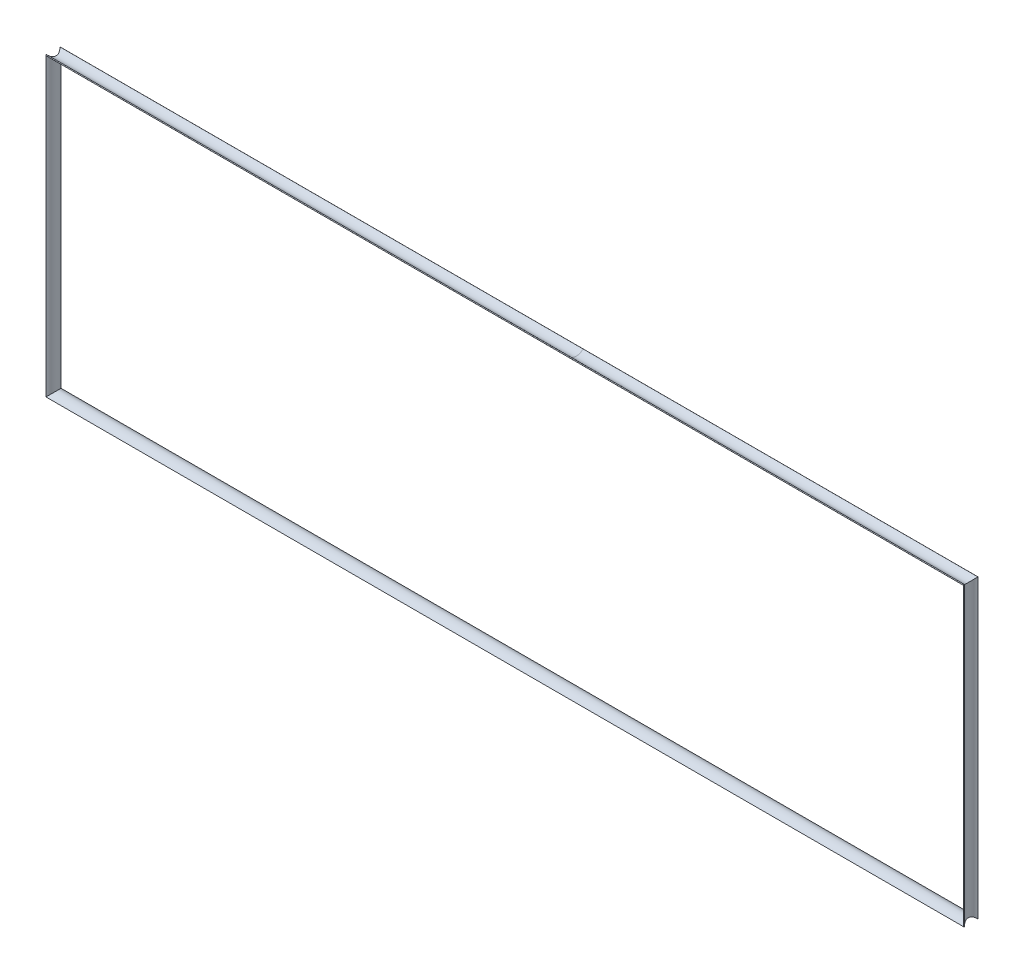
ISO-10303-21;
HEADER;
FILE_DESCRIPTION(('STEP AP214'),'2;1');
FILE_NAME('part.step','',(''),(''),'','','');
FILE_SCHEMA(('AUTOMOTIVE_DESIGN { 1 0 10303 214 1 1 1 1 }'));
ENDSEC;
DATA;
#1=APPLICATION_CONTEXT('core data for automotive mechanical design processes');
#2=APPLICATION_PROTOCOL_DEFINITION('international standard','automotive_design',2000,#1);
#3=PRODUCT_CONTEXT('',#1,'mechanical');
#4=PRODUCT('Part','Part','',(#3));
#5=PRODUCT_RELATED_PRODUCT_CATEGORY('part','',(#4));
#6=PRODUCT_DEFINITION_FORMATION('','',#4);
#7=PRODUCT_DEFINITION_CONTEXT('part definition',#1,'design');
#8=PRODUCT_DEFINITION('design','',#6,#7);
#9=PRODUCT_DEFINITION_SHAPE('','',#8);
#10=(LENGTH_UNIT() NAMED_UNIT(*) SI_UNIT(.MILLI.,.METRE.));
#11=(NAMED_UNIT(*) PLANE_ANGLE_UNIT() SI_UNIT($,.RADIAN.));
#12=(NAMED_UNIT(*) SI_UNIT($,.STERADIAN.) SOLID_ANGLE_UNIT());
#13=UNCERTAINTY_MEASURE_WITH_UNIT(LENGTH_MEASURE(1.E-05),#10,'distance_accuracy_value','');
#14=(GEOMETRIC_REPRESENTATION_CONTEXT(3) GLOBAL_UNCERTAINTY_ASSIGNED_CONTEXT((#13)) GLOBAL_UNIT_ASSIGNED_CONTEXT((#10,
#11,#12)) REPRESENTATION_CONTEXT('',''));
#15=CARTESIAN_POINT('',(0.,0.,0.));
#16=DIRECTION('',(0.,0.,1.));
#17=DIRECTION('',(1.,0.,0.));
#18=AXIS2_PLACEMENT_3D('',#15,#16,#17);
#19=CARTESIAN_POINT('',(-195.280679939792,-83.605890790914,2.55783681765596));
#20=DIRECTION('',(-0.772949387283598,0.,0.634467686094343));
#21=DIRECTION('',(0.634467686094343,0.,0.772949387283598));
#22=AXIS2_PLACEMENT_3D('',#19,#20,#21);
#23=PLANE('',#22);
#24=DIRECTION('',(0.,1.,0.));
#25=VECTOR('',#24,1.);
#26=CARTESIAN_POINT('',(-195.082811631117,-83.605890790914,2.79889273162191));
#27=LINE('',#26,#25);
#28=CARTESIAN_POINT('',(-195.082811631117,-83.273287821593,2.79889273162191));
#29=VERTEX_POINT('',#28);
#30=CARTESIAN_POINT('',(-195.082811631117,27.0256687739739,2.79889273162191));
#31=VERTEX_POINT('',#30);
#32=EDGE_CURVE('E38',#29,#31,#27,.T.);
#33=ORIENTED_EDGE('',*,*,#32,.T.);
#34=DIRECTION('',(-0.535735528742204,0.535735528742204,-0.652667516034483));
#35=VECTOR('',#34,1.);
#36=CARTESIAN_POINT('',(-195.319350479228,27.2622076220848,2.51072587659801));
#37=LINE('',#36,#35);
#38=CARTESIAN_POINT('',(-195.280679939792,27.2235370826491,2.55783681765596));
#39=VERTEX_POINT('',#38);
#40=EDGE_CURVE('E96',#31,#39,#37,.T.);
#41=ORIENTED_EDGE('',*,*,#40,.T.);
#42=DIRECTION('',(0.,1.,0.));
#43=VECTOR('',#42,1.);
#44=CARTESIAN_POINT('',(-195.280679939792,-83.605890790914,2.55783681765596));
#45=LINE('',#44,#43);
#46=CARTESIAN_POINT('',(-195.280679939792,-83.4711561302682,2.55783681765596));
#47=VERTEX_POINT('',#46);
#48=EDGE_CURVE('E167',#47,#39,#45,.T.);
#49=ORIENTED_EDGE('',*,*,#48,.F.);
#50=DIRECTION('',(-0.535735528742204,-0.535735528742204,-0.652667516034483));
#51=VECTOR('',#50,1.);
#52=CARTESIAN_POINT('',(-96.8843293143677,14.9251944951561,122.430606690375));
#53=LINE('',#52,#51);
#54=EDGE_CURVE('E227',#29,#47,#53,.T.);
#55=ORIENTED_EDGE('',*,*,#54,.F.);
#56=EDGE_LOOP('',(#33,#41,#49,#55));
#57=FACE_BOUND('',#56,.T.);
#58=ADVANCED_FACE('F35',(#57),#23,.T.);
#59=CARTESIAN_POINT('',(-197.480263626746,-83.605890790914,0.));
#60=DIRECTION('',(0.,1.,0.));
#61=DIRECTION('',(-1.,0.,0.));
#62=AXIS2_PLACEMENT_3D('',#59,#60,#61);
#63=CYLINDRICAL_SURFACE('',#62,3.37352895076791);
#64=ORIENTED_EDGE('',*,*,#48,.T.);
#65=CARTESIAN_POINT('',(-197.480263626746,29.4231207696028,0.));
#66=DIRECTION('',(0.707106781186547,0.707106781186547,0.));
#67=DIRECTION('',(0.707106781186548,-0.707106781186548,0.));
#68=AXIS2_PLACEMENT_3D('',#65,#66,#67);
#69=ELLIPSE('',#68,4.77089039523426,3.37352895076791);
#70=CARTESIAN_POINT('',(-195.21206854016,27.1549256830174,-2.49719615386114));
#71=VERTEX_POINT('',#70);
#72=EDGE_CURVE('E113',#39,#71,#69,.T.);
#73=ORIENTED_EDGE('',*,*,#72,.T.);
#74=DIRECTION('',(0.,1.,0.));
#75=VECTOR('',#74,1.);
#76=CARTESIAN_POINT('',(-195.21206854016,-83.605890790914,-2.49719615386114));
#77=LINE('',#76,#75);
#78=CARTESIAN_POINT('',(-195.21206854016,-83.4025447306364,-2.49719615386113));
#79=VERTEX_POINT('',#78);
#80=EDGE_CURVE('E109',#79,#71,#77,.T.);
#81=ORIENTED_EDGE('',*,*,#80,.F.);
#82=CARTESIAN_POINT('',(-197.480263626746,-85.6707398172219,0.));
#83=DIRECTION('',(-0.707106781186547,0.707106781186548,0.));
#84=DIRECTION('',(-0.707106781186548,-0.707106781186547,0.));
#85=AXIS2_PLACEMENT_3D('',#82,#83,#84);
#86=ELLIPSE('',#85,4.77089039523426,3.37352895076791);
#87=EDGE_CURVE('E173',#47,#79,#86,.T.);
#88=ORIENTED_EDGE('',*,*,#87,.F.);
#89=EDGE_LOOP('',(#64,#73,#81,#88));
#90=FACE_BOUND('',#89,.T.);
#91=ADVANCED_FACE('F171',(#90),#63,.F.);
#92=CARTESIAN_POINT('',(-195.002436190645,-83.605890790914,-2.72799336351454));
#93=DIRECTION('',(-0.74023261406804,0.,-0.672350858607316));
#94=DIRECTION('',(-0.672350858607316,0.,0.74023261406804));
#95=AXIS2_PLACEMENT_3D('',#92,#93,#94);
#96=PLANE('',#95);
#97=ORIENTED_EDGE('',*,*,#80,.T.);
#98=DIRECTION('',(0.557961623493486,-0.557961623493486,-0.614294435443644));
#99=VECTOR('',#98,1.);
#100=CARTESIAN_POINT('',(-195.131005113726,27.0738622565831,-2.5864438900491));
#101=LINE('',#100,#99);
#102=CARTESIAN_POINT('',(-195.002436190645,26.9452933335024,-2.72799336351454));
#103=VERTEX_POINT('',#102);
#104=EDGE_CURVE('E103',#71,#103,#101,.T.);
#105=ORIENTED_EDGE('',*,*,#104,.T.);
#106=DIRECTION('',(0.,1.,0.));
#107=VECTOR('',#106,1.);
#108=CARTESIAN_POINT('',(-195.002436190645,-83.605890790914,-2.72799336351454));
#109=LINE('',#108,#107);
#110=CARTESIAN_POINT('',(-195.002436190645,-83.1929123811215,-2.72799336351454));
#111=VERTEX_POINT('',#110);
#112=EDGE_CURVE('E106',#111,#103,#109,.T.);
#113=ORIENTED_EDGE('',*,*,#112,.F.);
#114=DIRECTION('',(0.557961623493486,0.557961623493486,-0.614294435443644));
#115=VECTOR('',#114,1.);
#116=CARTESIAN_POINT('',(-88.3589996366438,23.4505241728801,-120.138343633734));
#117=LINE('',#116,#115);
#118=EDGE_CURVE('E224',#79,#111,#117,.T.);
#119=ORIENTED_EDGE('',*,*,#118,.F.);
#120=EDGE_LOOP('',(#97,#105,#113,#119));
#121=FACE_BOUND('',#120,.T.);
#122=ADVANCED_FACE('F105',(#121),#96,.T.);
#123=CARTESIAN_POINT('',(-197.480263626746,-83.605890790914,0.));
#124=DIRECTION('',(0.,1.,0.));
#125=DIRECTION('',(-1.,0.,0.));
#126=AXIS2_PLACEMENT_3D('',#123,#124,#125);
#127=CYLINDRICAL_SURFACE('',#126,3.68531906277748);
#128=ORIENTED_EDGE('',*,*,#112,.T.);
#129=CARTESIAN_POINT('',(-197.480263626746,29.4231207696028,0.));
#130=DIRECTION('',(0.707106781186547,0.707106781186547,0.));
#131=DIRECTION('',(0.707106781186548,-0.707106781186548,0.));
#132=AXIS2_PLACEMENT_3D('',#129,#130,#131);
#133=ELLIPSE('',#132,5.21182820025201,3.68531906277748);
#134=EDGE_CURVE('E120',#103,#31,#133,.F.);
#135=ORIENTED_EDGE('',*,*,#134,.T.);
#136=ORIENTED_EDGE('',*,*,#32,.F.);
#137=CARTESIAN_POINT('',(-197.480263626746,-85.6707398172219,0.));
#138=DIRECTION('',(-0.707106781186547,0.707106781186548,0.));
#139=DIRECTION('',(-0.707106781186548,-0.707106781186547,0.));
#140=AXIS2_PLACEMENT_3D('',#137,#138,#139);
#141=ELLIPSE('',#140,5.21182820025201,3.68531906277748);
#142=EDGE_CURVE('E122',#111,#29,#141,.F.);
#143=ORIENTED_EDGE('',*,*,#142,.F.);
#144=EDGE_LOOP('',(#128,#135,#136,#143));
#145=FACE_BOUND('',#144,.T.);
#146=ADVANCED_FACE('F118',(#145),#127,.T.);
#147=CARTESIAN_POINT('',(-195.415414600438,29.4231207696028,0.));
#148=DIRECTION('',(1.,0.,0.));
#149=DIRECTION('',(0.,1.,0.));
#150=AXIS2_PLACEMENT_3D('',#147,#148,#149);
#151=CYLINDRICAL_SURFACE('',#150,3.68531906277748);
#152=ORIENTED_EDGE('',*,*,#134,.F.);
#153=DIRECTION('',(1.,0.,0.));
#154=VECTOR('',#153,1.);
#155=CARTESIAN_POINT('',(-195.415414600438,26.9452933335025,-2.72799336351454));
#156=LINE('',#155,#154);
#157=CARTESIAN_POINT('',(0.,26.9452933335025,-2.72799336351454));
#158=VERTEX_POINT('',#157);
#159=EDGE_CURVE('E127',#103,#158,#156,.T.);
#160=ORIENTED_EDGE('',*,*,#159,.T.);
#161=CARTESIAN_POINT('',(0.,29.4231207696028,0.));
#162=DIRECTION('',(1.,0.,0.));
#163=DIRECTION('',(0.,0.,-1.));
#164=AXIS2_PLACEMENT_3D('',#161,#162,#163);
#165=CIRCLE('',#164,3.68531906277748);
#166=CARTESIAN_POINT('',(0.,27.0256687739739,2.79889273162191));
#167=VERTEX_POINT('',#166);
#168=EDGE_CURVE('E144',#167,#158,#165,.T.);
#169=ORIENTED_EDGE('',*,*,#168,.F.);
#170=DIRECTION('',(1.,0.,0.));
#171=VECTOR('',#170,1.);
#172=CARTESIAN_POINT('',(-195.415414600438,27.0256687739739,2.79889273162191));
#173=LINE('',#172,#171);
#174=EDGE_CURVE('E129',#31,#167,#173,.T.);
#175=ORIENTED_EDGE('',*,*,#174,.F.);
#176=EDGE_LOOP('',(#152,#160,#169,#175));
#177=FACE_BOUND('',#176,.T.);
#178=ADVANCED_FACE('F125',(#177),#151,.T.);
#179=CARTESIAN_POINT('',(-195.415414600438,26.9452933335025,-2.72799336351454));
#180=DIRECTION('',(0.,0.74023261406804,-0.672350858607316));
#181=DIRECTION('',(0.,0.672350858607316,0.74023261406804));
#182=AXIS2_PLACEMENT_3D('',#179,#180,#181);
#183=PLANE('',#182);
#184=ORIENTED_EDGE('',*,*,#104,.F.);
#185=DIRECTION('',(1.,0.,0.));
#186=VECTOR('',#185,1.);
#187=CARTESIAN_POINT('',(-195.415414600438,27.1549256830174,-2.49719615386114));
#188=LINE('',#187,#186);
#189=CARTESIAN_POINT('',(0.,27.1549256830174,-2.49719615386114));
#190=VERTEX_POINT('',#189);
#191=EDGE_CURVE('E137',#71,#190,#188,.T.);
#192=ORIENTED_EDGE('',*,*,#191,.T.);
#193=DIRECTION('',(0.,0.672350858607316,0.74023261406804));
#194=VECTOR('',#193,1.);
#195=CARTESIAN_POINT('',(0.,26.9452933335025,-2.72799336351454));
#196=LINE('',#195,#194);
#197=EDGE_CURVE('E135',#158,#190,#196,.T.);
#198=ORIENTED_EDGE('',*,*,#197,.F.);
#199=ORIENTED_EDGE('',*,*,#159,.F.);
#200=EDGE_LOOP('',(#184,#192,#198,#199));
#201=FACE_BOUND('',#200,.T.);
#202=ADVANCED_FACE('F133',(#201),#183,.T.);
#203=CARTESIAN_POINT('',(-195.415414600438,29.4231207696028,0.));
#204=DIRECTION('',(1.,0.,0.));
#205=DIRECTION('',(0.,1.,0.));
#206=AXIS2_PLACEMENT_3D('',#203,#204,#205);
#207=CYLINDRICAL_SURFACE('',#206,3.37352895076791);
#208=ORIENTED_EDGE('',*,*,#72,.F.);
#209=DIRECTION('',(1.,0.,0.));
#210=VECTOR('',#209,1.);
#211=CARTESIAN_POINT('',(-195.415414600438,27.2235370826491,2.55783681765596));
#212=LINE('',#211,#210);
#213=CARTESIAN_POINT('',(0.,27.2235370826491,2.55783681765596));
#214=VERTEX_POINT('',#213);
#215=EDGE_CURVE('E139',#39,#214,#212,.T.);
#216=ORIENTED_EDGE('',*,*,#215,.T.);
#217=CARTESIAN_POINT('',(0.,29.4231207696028,0.));
#218=DIRECTION('',(-1.,0.,0.));
#219=DIRECTION('',(0.,0.,1.));
#220=AXIS2_PLACEMENT_3D('',#217,#218,#219);
#221=CIRCLE('',#220,3.37352895076791);
#222=EDGE_CURVE('E150',#190,#214,#221,.T.);
#223=ORIENTED_EDGE('',*,*,#222,.F.);
#224=ORIENTED_EDGE('',*,*,#191,.F.);
#225=EDGE_LOOP('',(#208,#216,#223,#224));
#226=FACE_BOUND('',#225,.T.);
#227=ADVANCED_FACE('F177',(#226),#207,.F.);
#228=CARTESIAN_POINT('',(-195.415414600438,27.2235370826491,2.55783681765596));
#229=DIRECTION('',(0.,0.772949387283598,0.634467686094343));
#230=DIRECTION('',(0.,-0.634467686094343,0.772949387283598));
#231=AXIS2_PLACEMENT_3D('',#228,#229,#230);
#232=PLANE('',#231);
#233=ORIENTED_EDGE('',*,*,#40,.F.);
#234=ORIENTED_EDGE('',*,*,#174,.T.);
#235=DIRECTION('',(0.,-0.634467686094343,0.772949387283598));
#236=VECTOR('',#235,1.);
#237=CARTESIAN_POINT('',(0.,27.2235370826491,2.55783681765596));
#238=LINE('',#237,#236);
#239=EDGE_CURVE('E153',#214,#167,#238,.T.);
#240=ORIENTED_EDGE('',*,*,#239,.F.);
#241=ORIENTED_EDGE('',*,*,#215,.F.);
#242=EDGE_LOOP('',(#233,#234,#240,#241));
#243=FACE_BOUND('',#242,.T.);
#244=ADVANCED_FACE('F182',(#243),#232,.T.);
#245=CARTESIAN_POINT('',(0.,29.4231207696028,0.));
#246=DIRECTION('',(1.,0.,0.));
#247=DIRECTION('',(0.,1.,0.));
#248=AXIS2_PLACEMENT_3D('',#245,#246,#247);
#249=CYLINDRICAL_SURFACE('',#248,3.68531906277748);
#250=DIRECTION('',(1.,0.,0.));
#251=VECTOR('',#250,1.);
#252=CARTESIAN_POINT('',(0.,26.9452933335025,-2.72799336351454));
#253=LINE('',#252,#251);
#254=CARTESIAN_POINT('',(147.135769523979,26.9452933335025,-2.72799336351454));
#255=VERTEX_POINT('',#254);
#256=EDGE_CURVE('E159',#158,#255,#253,.T.);
#257=ORIENTED_EDGE('',*,*,#256,.T.);
#258=CARTESIAN_POINT('',(149.613596960079,29.4231207696029,0.));
#259=DIRECTION('',(0.707106781186548,-0.707106781186547,0.));
#260=DIRECTION('',(-0.707106781186547,-0.707106781186548,0.));
#261=AXIS2_PLACEMENT_3D('',#258,#259,#260);
#262=ELLIPSE('',#261,5.21182820025201,3.68531906277748);
#263=CARTESIAN_POINT('',(147.21614496445,27.0256687739739,2.79889273162191));
#264=VERTEX_POINT('',#263);
#265=EDGE_CURVE('E202',#255,#264,#262,.F.);
#266=ORIENTED_EDGE('',*,*,#265,.T.);
#267=DIRECTION('',(1.,0.,0.));
#268=VECTOR('',#267,1.);
#269=CARTESIAN_POINT('',(0.,27.0256687739739,2.79889273162191));
#270=LINE('',#269,#268);
#271=EDGE_CURVE('E156',#167,#264,#270,.T.);
#272=ORIENTED_EDGE('',*,*,#271,.F.);
#273=ORIENTED_EDGE('',*,*,#168,.T.);
#274=EDGE_LOOP('',(#257,#266,#272,#273));
#275=FACE_BOUND('',#274,.T.);
#276=ADVANCED_FACE('F201',(#275),#249,.T.);
#277=CARTESIAN_POINT('',(0.,26.9452933335025,-2.72799336351454));
#278=DIRECTION('',(0.,0.74023261406804,-0.672350858607316));
#279=DIRECTION('',(0.,0.672350858607316,0.74023261406804));
#280=AXIS2_PLACEMENT_3D('',#277,#278,#279);
#281=PLANE('',#280);
#282=DIRECTION('',(1.,0.,0.));
#283=VECTOR('',#282,1.);
#284=CARTESIAN_POINT('',(0.,27.1549256830174,-2.49719615386114));
#285=LINE('',#284,#283);
#286=CARTESIAN_POINT('',(147.345401873494,27.1549256830174,-2.49719615386114));
#287=VERTEX_POINT('',#286);
#288=EDGE_CURVE('E162',#190,#287,#285,.T.);
#289=ORIENTED_EDGE('',*,*,#288,.T.);
#290=DIRECTION('',(-0.557961623493486,-0.557961623493486,-0.614294435443644));
#291=VECTOR('',#290,1.);
#292=CARTESIAN_POINT('',(147.264338447059,27.0738622565832,-2.5864438900491));
#293=LINE('',#292,#291);
#294=EDGE_CURVE('E197',#287,#255,#293,.T.);
#295=ORIENTED_EDGE('',*,*,#294,.T.);
#296=ORIENTED_EDGE('',*,*,#256,.F.);
#297=ORIENTED_EDGE('',*,*,#197,.T.);
#298=EDGE_LOOP('',(#289,#295,#296,#297));
#299=FACE_BOUND('',#298,.T.);
#300=ADVANCED_FACE('F192',(#299),#281,.T.);
#301=CARTESIAN_POINT('',(0.,29.4231207696028,0.));
#302=DIRECTION('',(1.,0.,0.));
#303=DIRECTION('',(0.,1.,0.));
#304=AXIS2_PLACEMENT_3D('',#301,#302,#303);
#305=CYLINDRICAL_SURFACE('',#304,3.37352895076791);
#306=DIRECTION('',(1.,0.,0.));
#307=VECTOR('',#306,1.);
#308=CARTESIAN_POINT('',(0.,27.2235370826491,2.55783681765596));
#309=LINE('',#308,#307);
#310=CARTESIAN_POINT('',(147.414013273125,27.2235370826492,2.55783681765595));
#311=VERTEX_POINT('',#310);
#312=EDGE_CURVE('E114',#214,#311,#309,.T.);
#313=ORIENTED_EDGE('',*,*,#312,.T.);
#314=CARTESIAN_POINT('',(149.613596960079,29.4231207696029,0.));
#315=DIRECTION('',(0.707106781186548,-0.707106781186547,0.));
#316=DIRECTION('',(-0.707106781186547,-0.707106781186548,0.));
#317=AXIS2_PLACEMENT_3D('',#314,#315,#316);
#318=ELLIPSE('',#317,4.77089039523426,3.37352895076791);
#319=EDGE_CURVE('E253',#311,#287,#318,.T.);
#320=ORIENTED_EDGE('',*,*,#319,.T.);
#321=ORIENTED_EDGE('',*,*,#288,.F.);
#322=ORIENTED_EDGE('',*,*,#222,.T.);
#323=EDGE_LOOP('',(#313,#320,#321,#322));
#324=FACE_BOUND('',#323,.T.);
#325=ADVANCED_FACE('F187',(#324),#305,.F.);
#326=CARTESIAN_POINT('',(0.,27.2235370826491,2.55783681765596));
#327=DIRECTION('',(0.,0.772949387283598,0.634467686094343));
#328=DIRECTION('',(0.,-0.634467686094343,0.772949387283598));
#329=AXIS2_PLACEMENT_3D('',#326,#327,#328);
#330=PLANE('',#329);
#331=ORIENTED_EDGE('',*,*,#271,.T.);
#332=DIRECTION('',(0.535735528742204,0.535735528742204,-0.652667516034483));
#333=VECTOR('',#332,1.);
#334=CARTESIAN_POINT('',(147.452683812561,27.2622076220849,2.51072587659801));
#335=LINE('',#334,#333);
#336=EDGE_CURVE('E209',#264,#311,#335,.T.);
#337=ORIENTED_EDGE('',*,*,#336,.T.);
#338=ORIENTED_EDGE('',*,*,#312,.F.);
#339=ORIENTED_EDGE('',*,*,#239,.T.);
#340=EDGE_LOOP('',(#331,#337,#338,#339));
#341=FACE_BOUND('',#340,.T.);
#342=ADVANCED_FACE('F280',(#341),#330,.T.);
#343=CARTESIAN_POINT('',(147.548747933771,-83.4711561302682,2.55783681765596));
#344=DIRECTION('',(0.,-0.772949387283598,0.634467686094343));
#345=DIRECTION('',(0.,-0.634467686094343,-0.772949387283598));
#346=AXIS2_PLACEMENT_3D('',#343,#344,#345);
#347=PLANE('',#346);
#348=DIRECTION('',(-1.,0.,0.));
#349=VECTOR('',#348,1.);
#350=CARTESIAN_POINT('',(147.548747933771,-83.273287821593,2.79889273162191));
#351=LINE('',#350,#349);
#352=CARTESIAN_POINT('',(147.21614496445,-83.273287821593,2.79889273162191));
#353=VERTEX_POINT('',#352);
#354=EDGE_CURVE('E236',#353,#29,#351,.T.);
#355=ORIENTED_EDGE('',*,*,#354,.T.);
#356=ORIENTED_EDGE('',*,*,#54,.T.);
#357=DIRECTION('',(-1.,0.,0.));
#358=VECTOR('',#357,1.);
#359=CARTESIAN_POINT('',(147.548747933771,-83.4711561302682,2.55783681765596));
#360=LINE('',#359,#358);
#361=CARTESIAN_POINT('',(147.414013273125,-83.4711561302682,2.55783681765596));
#362=VERTEX_POINT('',#361);
#363=EDGE_CURVE('E130',#362,#47,#360,.T.);
#364=ORIENTED_EDGE('',*,*,#363,.F.);
#365=DIRECTION('',(0.535735528742204,-0.535735528742204,-0.652667516034483));
#366=VECTOR('',#365,1.);
#367=CARTESIAN_POINT('',(115.604575815253,-51.6617186723958,41.3101416737971));
#368=LINE('',#367,#366);
#369=EDGE_CURVE('E243',#353,#362,#368,.T.);
#370=ORIENTED_EDGE('',*,*,#369,.F.);
#371=EDGE_LOOP('',(#355,#356,#364,#370));
#372=FACE_BOUND('',#371,.T.);
#373=ADVANCED_FACE('F240',(#372),#347,.T.);
#374=CARTESIAN_POINT('',(147.548747933771,-85.6707398172219,0.));
#375=DIRECTION('',(-1.,0.,0.));
#376=DIRECTION('',(0.,0.,1.));
#377=AXIS2_PLACEMENT_3D('',#374,#375,#376);
#378=CYLINDRICAL_SURFACE('',#377,3.37352895076791);
#379=ORIENTED_EDGE('',*,*,#363,.T.);
#380=ORIENTED_EDGE('',*,*,#87,.T.);
#381=DIRECTION('',(-1.,0.,0.));
#382=VECTOR('',#381,1.);
#383=CARTESIAN_POINT('',(147.548747933771,-83.4025447306364,-2.49719615386114));
#384=LINE('',#383,#382);
#385=CARTESIAN_POINT('',(147.345401873494,-83.4025447306364,-2.49719615386114));
#386=VERTEX_POINT('',#385);
#387=EDGE_CURVE('E231',#386,#79,#384,.T.);
#388=ORIENTED_EDGE('',*,*,#387,.F.);
#389=CARTESIAN_POINT('',(149.613596960079,-85.6707398172219,0.));
#390=DIRECTION('',(-0.707106781186547,-0.707106781186548,0.));
#391=DIRECTION('',(0.707106781186548,-0.707106781186547,0.));
#392=AXIS2_PLACEMENT_3D('',#389,#390,#391);
#393=ELLIPSE('',#392,4.77089039523426,3.37352895076791);
#394=EDGE_CURVE('E247',#362,#386,#393,.T.);
#395=ORIENTED_EDGE('',*,*,#394,.F.);
#396=EDGE_LOOP('',(#379,#380,#388,#395));
#397=FACE_BOUND('',#396,.T.);
#398=ADVANCED_FACE('F272',(#397),#378,.F.);
#399=CARTESIAN_POINT('',(147.548747933771,-83.1929123811215,-2.72799336351454));
#400=DIRECTION('',(0.,-0.74023261406804,-0.672350858607316));
#401=DIRECTION('',(0.,0.672350858607316,-0.74023261406804));
#402=AXIS2_PLACEMENT_3D('',#399,#400,#401);
#403=PLANE('',#402);
#404=ORIENTED_EDGE('',*,*,#387,.T.);
#405=ORIENTED_EDGE('',*,*,#118,.T.);
#406=DIRECTION('',(-1.,0.,0.));
#407=VECTOR('',#406,1.);
#408=CARTESIAN_POINT('',(147.548747933771,-83.1929123811215,-2.72799336351454));
#409=LINE('',#408,#407);
#410=CARTESIAN_POINT('',(147.135769523979,-83.1929123811216,-2.72799336351454));
#411=VERTEX_POINT('',#410);
#412=EDGE_CURVE('E234',#411,#111,#409,.T.);
#413=ORIENTED_EDGE('',*,*,#412,.F.);
#414=DIRECTION('',(-0.557961623493486,0.557961623493486,-0.614294435443644));
#415=VECTOR('',#414,1.);
#416=CARTESIAN_POINT('',(112.718845173602,-48.775988030745,-40.619712477003));
#417=LINE('',#416,#415);
#418=EDGE_CURVE('E217',#386,#411,#417,.T.);
#419=ORIENTED_EDGE('',*,*,#418,.F.);
#420=EDGE_LOOP('',(#404,#405,#413,#419));
#421=FACE_BOUND('',#420,.T.);
#422=ADVANCED_FACE('F270',(#421),#403,.T.);
#423=CARTESIAN_POINT('',(147.548747933771,-85.6707398172219,0.));
#424=DIRECTION('',(-1.,0.,0.));
#425=DIRECTION('',(0.,0.,1.));
#426=AXIS2_PLACEMENT_3D('',#423,#424,#425);
#427=CYLINDRICAL_SURFACE('',#426,3.68531906277748);
#428=ORIENTED_EDGE('',*,*,#412,.T.);
#429=ORIENTED_EDGE('',*,*,#142,.T.);
#430=ORIENTED_EDGE('',*,*,#354,.F.);
#431=CARTESIAN_POINT('',(149.613596960079,-85.6707398172219,0.));
#432=DIRECTION('',(-0.707106781186547,-0.707106781186548,0.));
#433=DIRECTION('',(0.707106781186548,-0.707106781186547,0.));
#434=AXIS2_PLACEMENT_3D('',#431,#432,#433);
#435=ELLIPSE('',#434,5.21182820025201,3.68531906277748);
#436=EDGE_CURVE('E53',#411,#353,#435,.F.);
#437=ORIENTED_EDGE('',*,*,#436,.F.);
#438=EDGE_LOOP('',(#428,#429,#430,#437));
#439=FACE_BOUND('',#438,.T.);
#440=ADVANCED_FACE('F238',(#439),#427,.T.);
#441=CARTESIAN_POINT('',(147.414013273125,27.358271743295,2.55783681765596));
#442=DIRECTION('',(0.772949387283598,0.,0.634467686094343));
#443=DIRECTION('',(0.634467686094343,0.,-0.772949387283598));
#444=AXIS2_PLACEMENT_3D('',#441,#442,#443);
#445=PLANE('',#444);
#446=ORIENTED_EDGE('',*,*,#336,.F.);
#447=DIRECTION('',(0.,-1.,0.));
#448=VECTOR('',#447,1.);
#449=CARTESIAN_POINT('',(147.21614496445,27.358271743295,2.79889273162191));
#450=LINE('',#449,#448);
#451=EDGE_CURVE('E11',#264,#353,#450,.T.);
#452=ORIENTED_EDGE('',*,*,#451,.T.);
#453=ORIENTED_EDGE('',*,*,#369,.T.);
#454=DIRECTION('',(0.,-1.,0.));
#455=VECTOR('',#454,1.);
#456=CARTESIAN_POINT('',(147.414013273125,27.358271743295,2.55783681765596));
#457=LINE('',#456,#455);
#458=EDGE_CURVE('E220',#311,#362,#457,.T.);
#459=ORIENTED_EDGE('',*,*,#458,.F.);
#460=EDGE_LOOP('',(#446,#452,#453,#459));
#461=FACE_BOUND('',#460,.T.);
#462=ADVANCED_FACE('F263',(#461),#445,.T.);
#463=CARTESIAN_POINT('',(149.613596960079,27.358271743295,0.));
#464=DIRECTION('',(0.,-1.,0.));
#465=DIRECTION('',(1.,0.,0.));
#466=AXIS2_PLACEMENT_3D('',#463,#464,#465);
#467=CYLINDRICAL_SURFACE('',#466,3.37352895076791);
#468=ORIENTED_EDGE('',*,*,#319,.F.);
#469=ORIENTED_EDGE('',*,*,#458,.T.);
#470=ORIENTED_EDGE('',*,*,#394,.T.);
#471=DIRECTION('',(0.,-1.,0.));
#472=VECTOR('',#471,1.);
#473=CARTESIAN_POINT('',(147.345401873494,27.358271743295,-2.49719615386114));
#474=LINE('',#473,#472);
#475=EDGE_CURVE('E218',#287,#386,#474,.T.);
#476=ORIENTED_EDGE('',*,*,#475,.F.);
#477=EDGE_LOOP('',(#468,#469,#470,#476));
#478=FACE_BOUND('',#477,.T.);
#479=ADVANCED_FACE('F259',(#478),#467,.F.);
#480=CARTESIAN_POINT('',(147.135769523979,27.358271743295,-2.72799336351454));
#481=DIRECTION('',(0.74023261406804,0.,-0.672350858607317));
#482=DIRECTION('',(-0.672350858607317,0.,-0.74023261406804));
#483=AXIS2_PLACEMENT_3D('',#480,#481,#482);
#484=PLANE('',#483);
#485=ORIENTED_EDGE('',*,*,#294,.F.);
#486=ORIENTED_EDGE('',*,*,#475,.T.);
#487=ORIENTED_EDGE('',*,*,#418,.T.);
#488=DIRECTION('',(0.,-1.,0.));
#489=VECTOR('',#488,1.);
#490=CARTESIAN_POINT('',(147.135769523979,27.358271743295,-2.72799336351454));
#491=LINE('',#490,#489);
#492=EDGE_CURVE('E44',#255,#411,#491,.T.);
#493=ORIENTED_EDGE('',*,*,#492,.F.);
#494=EDGE_LOOP('',(#485,#486,#487,#493));
#495=FACE_BOUND('',#494,.T.);
#496=ADVANCED_FACE('F213',(#495),#484,.T.);
#497=CARTESIAN_POINT('',(149.613596960079,27.358271743295,0.));
#498=DIRECTION('',(0.,-1.,0.));
#499=DIRECTION('',(1.,0.,0.));
#500=AXIS2_PLACEMENT_3D('',#497,#498,#499);
#501=CYLINDRICAL_SURFACE('',#500,3.68531906277748);
#502=ORIENTED_EDGE('',*,*,#265,.F.);
#503=ORIENTED_EDGE('',*,*,#492,.T.);
#504=ORIENTED_EDGE('',*,*,#436,.T.);
#505=ORIENTED_EDGE('',*,*,#451,.F.);
#506=EDGE_LOOP('',(#502,#503,#504,#505));
#507=FACE_BOUND('',#506,.T.);
#508=ADVANCED_FACE('F208',(#507),#501,.T.);
#509=CLOSED_SHELL('',(#58,#91,#122,#146,#178,#202,#227,#244,#276,#300,#325,#342,#373,#398,#422,
#440,#462,#479,#496,#508));
#510=MANIFOLD_SOLID_BREP('B2',#509);
#511=ADVANCED_BREP_SHAPE_REPRESENTATION('',(#18,#510),#14);
#512=SHAPE_DEFINITION_REPRESENTATION(#9,#511);
ENDSEC;
END-ISO-10303-21;
